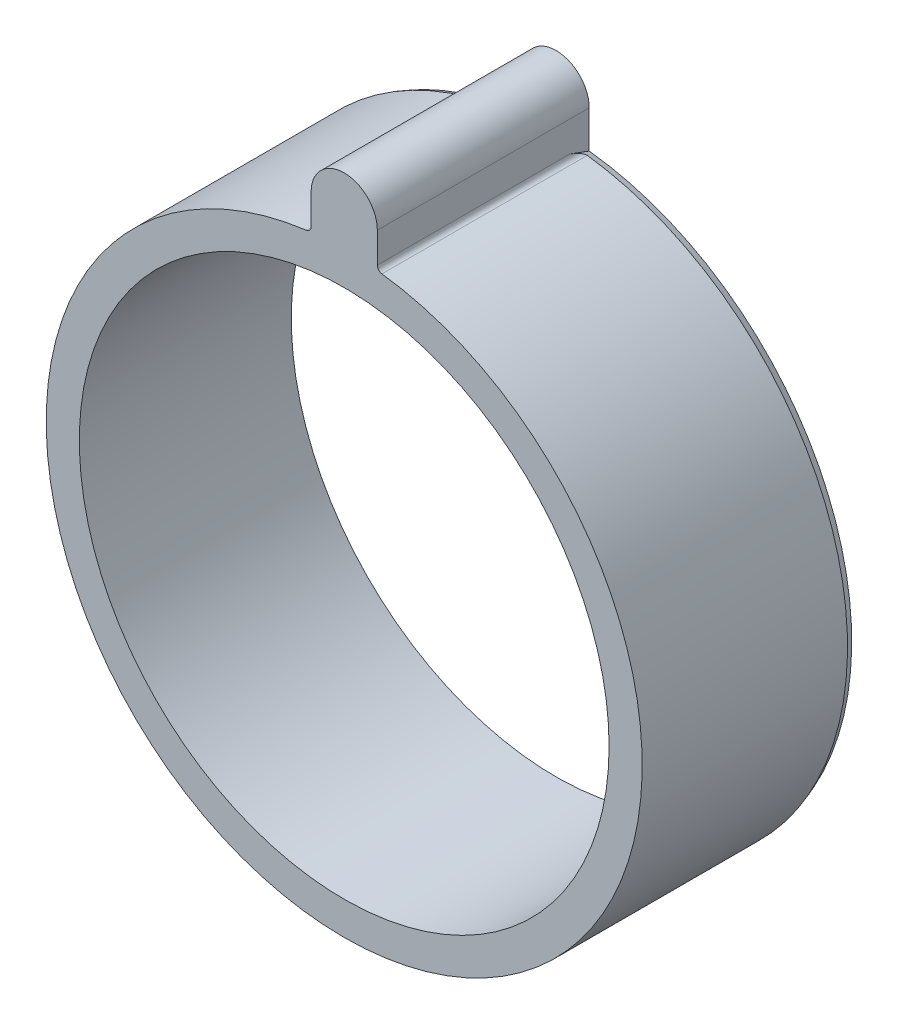
ISO-10303-21;
HEADER;
FILE_DESCRIPTION(('STEP AP214'),'2;1');
FILE_NAME('part.step','',(''),(''),'','','');
FILE_SCHEMA(('AUTOMOTIVE_DESIGN { 1 0 10303 214 1 1 1 1 }'));
ENDSEC;
DATA;
#1=APPLICATION_CONTEXT('core data for automotive mechanical design processes');
#2=APPLICATION_PROTOCOL_DEFINITION('international standard','automotive_design',2000,#1);
#3=PRODUCT_CONTEXT('',#1,'mechanical');
#4=PRODUCT('Part','Part','',(#3));
#5=PRODUCT_RELATED_PRODUCT_CATEGORY('part','',(#4));
#6=PRODUCT_DEFINITION_FORMATION('','',#4);
#7=PRODUCT_DEFINITION_CONTEXT('part definition',#1,'design');
#8=PRODUCT_DEFINITION('design','',#6,#7);
#9=PRODUCT_DEFINITION_SHAPE('','',#8);
#10=(LENGTH_UNIT() NAMED_UNIT(*) SI_UNIT(.MILLI.,.METRE.));
#11=(NAMED_UNIT(*) PLANE_ANGLE_UNIT() SI_UNIT($,.RADIAN.));
#12=(NAMED_UNIT(*) SI_UNIT($,.STERADIAN.) SOLID_ANGLE_UNIT());
#13=UNCERTAINTY_MEASURE_WITH_UNIT(LENGTH_MEASURE(1.E-05),#10,'distance_accuracy_value','');
#14=(GEOMETRIC_REPRESENTATION_CONTEXT(3) GLOBAL_UNCERTAINTY_ASSIGNED_CONTEXT((#13)) GLOBAL_UNIT_ASSIGNED_CONTEXT((#10,
#11,#12)) REPRESENTATION_CONTEXT('',''));
#15=CARTESIAN_POINT('',(0.,0.,0.));
#16=DIRECTION('',(0.,0.,1.));
#17=DIRECTION('',(1.,0.,0.));
#18=AXIS2_PLACEMENT_3D('',#15,#16,#17);
#19=CARTESIAN_POINT('',(0.,0.,16.));
#20=DIRECTION('',(0.,0.,1.));
#21=DIRECTION('',(1.,0.,0.));
#22=AXIS2_PLACEMENT_3D('',#19,#20,#21);
#23=PLANE('',#22);
#24=DIRECTION('',(0.,-1.,0.));
#25=VECTOR('',#24,1.);
#26=CARTESIAN_POINT('',(-2.5,25.,16.));
#27=LINE('',#26,#25);
#28=CARTESIAN_POINT('',(-2.5,25.,16.));
#29=VERTEX_POINT('',#28);
#30=CARTESIAN_POINT('',(-2.5,22.7156333832011,16.));
#31=VERTEX_POINT('',#30);
#32=EDGE_CURVE('E115',#29,#31,#27,.T.);
#33=ORIENTED_EDGE('',*,*,#32,.T.);
#34=CARTESIAN_POINT('',(-2.9,22.7156333832011,16.));
#35=DIRECTION('',(0.,0.,1.));
#36=DIRECTION('',(1.,0.,0.));
#37=AXIS2_PLACEMENT_3D('',#34,#35,#36);
#38=CIRCLE('',#37,0.4);
#39=CARTESIAN_POINT('',(-2.84934497816594,22.3188537607871,16.));
#40=VERTEX_POINT('',#39);
#41=EDGE_CURVE('E53',#31,#40,#38,.F.);
#42=ORIENTED_EDGE('',*,*,#41,.T.);
#43=CARTESIAN_POINT('',(0.,0.,16.));
#44=DIRECTION('',(0.,0.,1.));
#45=DIRECTION('',(1.,0.,0.));
#46=AXIS2_PLACEMENT_3D('',#43,#44,#45);
#47=CIRCLE('',#46,22.5);
#48=CARTESIAN_POINT('',(2.84934497816594,22.3188537607871,16.));
#49=VERTEX_POINT('',#48);
#50=EDGE_CURVE('E136',#40,#49,#47,.T.);
#51=ORIENTED_EDGE('',*,*,#50,.T.);
#52=CARTESIAN_POINT('',(2.9,22.7156333832011,16.));
#53=DIRECTION('',(0.,0.,1.));
#54=DIRECTION('',(1.,0.,0.));
#55=AXIS2_PLACEMENT_3D('',#52,#53,#54);
#56=CIRCLE('',#55,0.4);
#57=CARTESIAN_POINT('',(2.5,22.7156333832011,16.));
#58=VERTEX_POINT('',#57);
#59=EDGE_CURVE('E200',#49,#58,#56,.F.);
#60=ORIENTED_EDGE('',*,*,#59,.T.);
#61=DIRECTION('',(0.,1.,0.));
#62=VECTOR('',#61,1.);
#63=CARTESIAN_POINT('',(2.5,25.,16.));
#64=LINE('',#63,#62);
#65=CARTESIAN_POINT('',(2.5,25.,16.));
#66=VERTEX_POINT('',#65);
#67=EDGE_CURVE('E112',#58,#66,#64,.T.);
#68=ORIENTED_EDGE('',*,*,#67,.T.);
#69=CARTESIAN_POINT('',(0.,25.,16.));
#70=DIRECTION('',(0.,0.,1.));
#71=DIRECTION('',(-1.,0.,0.));
#72=AXIS2_PLACEMENT_3D('',#69,#70,#71);
#73=CIRCLE('',#72,2.5);
#74=EDGE_CURVE('E109',#66,#29,#73,.T.);
#75=ORIENTED_EDGE('',*,*,#74,.T.);
#76=EDGE_LOOP('',(#33,#42,#51,#60,#68,#75));
#77=FACE_BOUND('',#76,.T.);
#78=CARTESIAN_POINT('',(0.,0.,16.));
#79=DIRECTION('',(0.,0.,1.));
#80=DIRECTION('',(1.,0.,0.));
#81=AXIS2_PLACEMENT_3D('',#78,#79,#80);
#82=CIRCLE('',#81,20.);
#83=CARTESIAN_POINT('',(20.,0.,16.));
#84=VERTEX_POINT('',#83);
#85=EDGE_CURVE('E133',#84,#84,#82,.T.);
#86=ORIENTED_EDGE('',*,*,#85,.F.);
#87=EDGE_LOOP('',(#86));
#88=FACE_BOUND('',#87,.T.);
#89=ADVANCED_FACE('F39',(#77,#88),#23,.T.);
#90=CARTESIAN_POINT('',(0.,0.,0.));
#91=DIRECTION('',(0.,0.,1.));
#92=DIRECTION('',(1.,0.,0.));
#93=AXIS2_PLACEMENT_3D('',#90,#91,#92);
#94=PLANE('',#93);
#95=DIRECTION('',(0.,-1.,0.));
#96=VECTOR('',#95,1.);
#97=CARTESIAN_POINT('',(2.5,25.,0.));
#98=LINE('',#97,#96);
#99=CARTESIAN_POINT('',(2.5,25.,0.));
#100=VERTEX_POINT('',#99);
#101=CARTESIAN_POINT('',(2.5,22.1775514498754,0.));
#102=VERTEX_POINT('',#101);
#103=EDGE_CURVE('E128',#100,#102,#98,.T.);
#104=ORIENTED_EDGE('',*,*,#103,.T.);
#105=CARTESIAN_POINT('',(0.,0.,0.));
#106=DIRECTION('',(0.,0.,1.));
#107=DIRECTION('',(1.,0.,0.));
#108=AXIS2_PLACEMENT_3D('',#105,#106,#107);
#109=CIRCLE('',#108,22.3180148828669);
#110=CARTESIAN_POINT('',(-2.5,22.1775514498754,0.));
#111=VERTEX_POINT('',#110);
#112=EDGE_CURVE('E144',#102,#111,#109,.F.);
#113=ORIENTED_EDGE('',*,*,#112,.T.);
#114=DIRECTION('',(0.,1.,0.));
#115=VECTOR('',#114,1.);
#116=CARTESIAN_POINT('',(-2.5,25.,0.));
#117=LINE('',#116,#115);
#118=CARTESIAN_POINT('',(-2.5,25.,0.));
#119=VERTEX_POINT('',#118);
#120=EDGE_CURVE('E130',#111,#119,#117,.T.);
#121=ORIENTED_EDGE('',*,*,#120,.T.);
#122=CARTESIAN_POINT('',(0.,25.,0.));
#123=DIRECTION('',(0.,0.,1.));
#124=DIRECTION('',(1.,0.,0.));
#125=AXIS2_PLACEMENT_3D('',#122,#123,#124);
#126=CIRCLE('',#125,2.5);
#127=EDGE_CURVE('E110',#119,#100,#126,.F.);
#128=ORIENTED_EDGE('',*,*,#127,.T.);
#129=EDGE_LOOP('',(#104,#113,#121,#128));
#130=FACE_BOUND('',#129,.T.);
#131=CARTESIAN_POINT('',(0.,0.,0.));
#132=DIRECTION('',(0.,0.,1.));
#133=DIRECTION('',(1.,0.,0.));
#134=AXIS2_PLACEMENT_3D('',#131,#132,#133);
#135=CIRCLE('',#134,20.);
#136=CARTESIAN_POINT('',(20.,0.,0.));
#137=VERTEX_POINT('',#136);
#138=EDGE_CURVE('E132',#137,#137,#135,.T.);
#139=ORIENTED_EDGE('',*,*,#138,.T.);
#140=EDGE_LOOP('',(#139));
#141=FACE_BOUND('',#140,.T.);
#142=ADVANCED_FACE('F180',(#130,#141),#94,.F.);
#143=CARTESIAN_POINT('',(0.,0.,16.));
#144=DIRECTION('',(0.,0.,-1.));
#145=DIRECTION('',(-1.,0.,0.));
#146=AXIS2_PLACEMENT_3D('',#143,#144,#145);
#147=CYLINDRICAL_SURFACE('',#146,22.5);
#148=CARTESIAN_POINT('',(0.,0.,0.500000000000007));
#149=DIRECTION('',(0.,0.,1.));
#150=DIRECTION('',(1.,0.,0.));
#151=AXIS2_PLACEMENT_3D('',#148,#149,#150);
#152=CIRCLE('',#151,22.5);
#153=CARTESIAN_POINT('',(-2.84934497816594,22.3188537607871,0.500000000000007));
#154=VERTEX_POINT('',#153);
#155=CARTESIAN_POINT('',(2.84934497816594,22.3188537607871,0.500000000000007));
#156=VERTEX_POINT('',#155);
#157=EDGE_CURVE('E141',#154,#156,#152,.T.);
#158=ORIENTED_EDGE('',*,*,#157,.T.);
#159=DIRECTION('',(0.,0.,-1.));
#160=VECTOR('',#159,1.);
#161=CARTESIAN_POINT('',(2.84934497816594,22.3188537607871,16.));
#162=LINE('',#161,#160);
#163=EDGE_CURVE('E191',#156,#49,#162,.F.);
#164=ORIENTED_EDGE('',*,*,#163,.T.);
#165=ORIENTED_EDGE('',*,*,#50,.F.);
#166=DIRECTION('',(0.,0.,-1.));
#167=VECTOR('',#166,1.);
#168=CARTESIAN_POINT('',(-2.84934497816594,22.3188537607871,16.));
#169=LINE('',#168,#167);
#170=EDGE_CURVE('E192',#40,#154,#169,.T.);
#171=ORIENTED_EDGE('',*,*,#170,.T.);
#172=EDGE_LOOP('',(#158,#164,#165,#171));
#173=FACE_BOUND('',#172,.T.);
#174=ADVANCED_FACE('F176',(#173),#147,.T.);
#175=CARTESIAN_POINT('',(0.,0.,16.));
#176=DIRECTION('',(0.,0.,-1.));
#177=DIRECTION('',(-1.,0.,0.));
#178=AXIS2_PLACEMENT_3D('',#175,#176,#177);
#179=CYLINDRICAL_SURFACE('',#178,20.);
#180=ORIENTED_EDGE('',*,*,#85,.T.);
#181=EDGE_LOOP('',(#180));
#182=FACE_BOUND('',#181,.T.);
#183=ORIENTED_EDGE('',*,*,#138,.F.);
#184=EDGE_LOOP('',(#183));
#185=FACE_BOUND('',#184,.T.);
#186=ADVANCED_FACE('F173',(#182,#185),#179,.F.);
#187=CARTESIAN_POINT('',(0.,25.,-7.1702588778311));
#188=DIRECTION('',(0.,0.,1.));
#189=DIRECTION('',(1.,0.,0.));
#190=AXIS2_PLACEMENT_3D('',#187,#188,#189);
#191=CYLINDRICAL_SURFACE('',#190,2.5);
#192=ORIENTED_EDGE('',*,*,#127,.F.);
#193=DIRECTION('',(0.,0.,1.));
#194=VECTOR('',#193,1.);
#195=CARTESIAN_POINT('',(-2.5,25.,-7.1702588778311));
#196=LINE('',#195,#194);
#197=EDGE_CURVE('E104',#119,#29,#196,.T.);
#198=ORIENTED_EDGE('',*,*,#197,.T.);
#199=ORIENTED_EDGE('',*,*,#74,.F.);
#200=DIRECTION('',(0.,0.,1.));
#201=VECTOR('',#200,1.);
#202=CARTESIAN_POINT('',(2.5,25.,-7.1702588778311));
#203=LINE('',#202,#201);
#204=EDGE_CURVE('E111',#100,#66,#203,.T.);
#205=ORIENTED_EDGE('',*,*,#204,.F.);
#206=EDGE_LOOP('',(#192,#198,#199,#205));
#207=FACE_BOUND('',#206,.T.);
#208=ADVANCED_FACE('F106',(#207),#191,.T.);
#209=CARTESIAN_POINT('',(2.5,25.,-7.1702588778311));
#210=DIRECTION('',(1.,0.,0.));
#211=DIRECTION('',(0.,1.,0.));
#212=AXIS2_PLACEMENT_3D('',#209,#210,#211);
#213=PLANE('',#212);
#214=ORIENTED_EDGE('',*,*,#67,.F.);
#215=DIRECTION('',(0.,0.,-1.));
#216=VECTOR('',#215,1.);
#217=CARTESIAN_POINT('',(2.5,22.7156333832011,-7.1702588778311));
#218=LINE('',#217,#216);
#219=CARTESIAN_POINT('',(2.5,22.7156333832011,1.46928191055004));
#220=VERTEX_POINT('',#219);
#221=EDGE_CURVE('E201',#58,#220,#218,.T.);
#222=ORIENTED_EDGE('',*,*,#221,.T.);
#223=CARTESIAN_POINT('',(2.5,22.7156333832011,1.46928191055004));
#224=CARTESIAN_POINT('',(2.5,22.597325661549,1.14618422396013));
#225=CARTESIAN_POINT('',(2.5,22.4790077921479,0.823090253776789));
#226=CARTESIAN_POINT('',(2.5,22.2996397003356,0.333332344374636));
#227=CARTESIAN_POINT('',(2.5,22.2385969252948,0.166665677707967));
#228=CARTESIAN_POINT('',(2.5,22.1775514498754,0.));
#229=B_SPLINE_CURVE_WITH_KNOTS('',3,(#223,#224,#225,#226,#227,#228),.UNSPECIFIED.,.F.,.F.,(4,2,
4),(0.,1.03223034546364,1.56471131551064),.UNSPECIFIED.);
#230=EDGE_CURVE('E147',#220,#102,#229,.T.);
#231=ORIENTED_EDGE('',*,*,#230,.T.);
#232=ORIENTED_EDGE('',*,*,#103,.F.);
#233=ORIENTED_EDGE('',*,*,#204,.T.);
#234=EDGE_LOOP('',(#214,#222,#231,#232,#233));
#235=FACE_BOUND('',#234,.T.);
#236=ADVANCED_FACE('F164',(#235),#213,.T.);
#237=CARTESIAN_POINT('',(-2.5,25.,-7.1702588778311));
#238=DIRECTION('',(-1.,0.,0.));
#239=DIRECTION('',(0.,-1.,0.));
#240=AXIS2_PLACEMENT_3D('',#237,#238,#239);
#241=PLANE('',#240);
#242=CARTESIAN_POINT('',(-2.5,22.1775514498754,0.));
#243=CARTESIAN_POINT('',(-2.5,22.2385969252948,0.166665677707967));
#244=CARTESIAN_POINT('',(-2.5,22.2996397003356,0.333332344374636));
#245=CARTESIAN_POINT('',(-2.5,22.4790077921479,0.82309025377679));
#246=CARTESIAN_POINT('',(-2.5,22.597325661549,1.14618422396013));
#247=CARTESIAN_POINT('',(-2.5,22.7156333832011,1.46928191055004));
#248=B_SPLINE_CURVE_WITH_KNOTS('',3,(#242,#243,#244,#245,#246,#247),.UNSPECIFIED.,.F.,.F.,(4,2,
4),(0.,0.532480970047001,1.56471131551064),.UNSPECIFIED.);
#249=CARTESIAN_POINT('',(-2.5,22.7156333832011,1.46928191055004));
#250=VERTEX_POINT('',#249);
#251=EDGE_CURVE('E60',#111,#250,#248,.T.);
#252=ORIENTED_EDGE('',*,*,#251,.T.);
#253=DIRECTION('',(0.,0.,-1.));
#254=VECTOR('',#253,1.);
#255=CARTESIAN_POINT('',(-2.5,22.7156333832011,-7.1702588778311));
#256=LINE('',#255,#254);
#257=EDGE_CURVE('E117',#250,#31,#256,.F.);
#258=ORIENTED_EDGE('',*,*,#257,.T.);
#259=ORIENTED_EDGE('',*,*,#32,.F.);
#260=ORIENTED_EDGE('',*,*,#197,.F.);
#261=ORIENTED_EDGE('',*,*,#120,.F.);
#262=EDGE_LOOP('',(#252,#258,#259,#260,#261));
#263=FACE_BOUND('',#262,.T.);
#264=ADVANCED_FACE('F116',(#263),#241,.T.);
#265=CARTESIAN_POINT('',(0.,0.,0.500000000000007));
#266=DIRECTION('',(0.,0.,1.));
#267=DIRECTION('',(1.,0.,0.));
#268=AXIS2_PLACEMENT_3D('',#265,#266,#267);
#269=CONICAL_SURFACE('',#268,22.5,0.349065850398861);
#270=ORIENTED_EDGE('',*,*,#251,.F.);
#271=ORIENTED_EDGE('',*,*,#112,.F.);
#272=ORIENTED_EDGE('',*,*,#230,.F.);
#273=CARTESIAN_POINT('',(2.5,22.7156333832011,1.46928191055004));
#274=CARTESIAN_POINT('',(2.50000192493231,22.7042578531929,1.43821614772649));
#275=CARTESIAN_POINT('',(2.50048438834367,22.6928369567121,1.40717096364287));
#276=CARTESIAN_POINT('',(2.50245595860717,22.669903101481,1.34513427997803));
#277=CARTESIAN_POINT('',(2.50394542468342,22.6583901113273,1.31414280351237));
#278=CARTESIAN_POINT('',(2.51004374622932,22.6234279086136,1.22051007554359));
#279=CARTESIAN_POINT('',(2.51628514184384,22.5998464085694,1.1580060038236));
#280=CARTESIAN_POINT('',(2.52967610432765,22.563878942228,1.06388850484792));
#281=CARTESIAN_POINT('',(2.53492564573257,22.5515957453108,1.03195908505263));
#282=CARTESIAN_POINT('',(2.54702304011259,22.5269639040905,0.968432985900389));
#283=CARTESIAN_POINT('',(2.5538704447194,22.5146152790951,0.936836215794927));
#284=CARTESIAN_POINT('',(2.5694393111456,22.4899310655111,0.874290435927235));
#285=CARTESIAN_POINT('',(2.57815121258051,22.4775957215326,0.843338974055171));
#286=CARTESIAN_POINT('',(2.59794949687018,22.4529219347645,0.782218750509542));
#287=CARTESIAN_POINT('',(2.60903318763368,22.4405835111993,0.75204914456074));
#288=CARTESIAN_POINT('',(2.62876908820094,22.4214756174575,0.706201459176869));
#289=CARTESIAN_POINT('',(2.63630355501161,22.4146748521007,0.690057146277416));
#290=CARTESIAN_POINT('',(2.65261328857511,22.4011294799934,0.658349811816629));
#291=CARTESIAN_POINT('',(2.66138962385319,22.3943849269567,0.642787305583973));
#292=CARTESIAN_POINT('',(2.68058750984192,22.3809740168902,0.612449015276655));
#293=CARTESIAN_POINT('',(2.69102251045424,22.3743088247027,0.59768111286172));
#294=CARTESIAN_POINT('',(2.71397180107856,22.361278055781,0.569700876100408));
#295=CARTESIAN_POINT('',(2.72647906584701,22.3549115569599,0.556483535308337));
#296=CARTESIAN_POINT('',(2.74746591590215,22.3457778508099,0.538593184484123));
#297=CARTESIAN_POINT('',(2.75495040730471,22.3427646136131,0.532888655623412));
#298=CARTESIAN_POINT('',(2.77071311073958,22.3370106391887,0.522514755281589));
#299=CARTESIAN_POINT('',(2.77899073733942,22.3342697039662,0.517844628587751));
#300=CARTESIAN_POINT('',(2.79495200909085,22.3295987647419,0.510542173776725));
#301=CARTESIAN_POINT('',(2.80252263850288,22.3276090644099,0.507704396857778));
#302=CARTESIAN_POINT('',(2.81810223213672,22.3240266562852,0.503284916525408));
#303=CARTESIAN_POINT('',(2.82610993002546,22.3224328688671,0.501699770914151));
#304=CARTESIAN_POINT('',(2.83923434855224,22.3202422716091,0.500271091294549));
#305=CARTESIAN_POINT('',(2.84428243234935,22.3194974961855,0.499992842240241));
#306=CARTESIAN_POINT('',(2.84934497816594,22.3188537607871,0.500000000000012));
#307=B_SPLINE_CURVE_WITH_KNOTS('',3,(#273,#274,#275,#276,#277,#278,#279,#280,#281,#282,#283,
#284,#285,#286,#287,#288,#289,#290,#291,#292,#293,#294,#295,#296,#297,#298,#299,#300,#301,#302,
#303,#304,#305,#306),.UNSPECIFIED.,.F.,.F.,(4,2,2,2,2,2,2,2,2,2,2,2,2,2,2,2,4),(0.,
0.099237249749412,0.198509918705497,0.399592402204581,0.5033976659599,0.60717383639763,
0.710430115608807,0.813569809975554,0.870744357527812,0.927968401614198,0.985682663680228,
1.0432051267977,1.07278313783145,1.10233948237452,1.12722267846065,1.15203725606338,
1.16733837151504),.UNSPECIFIED.);
#308=EDGE_CURVE('E199',#220,#156,#307,.T.);
#309=ORIENTED_EDGE('',*,*,#308,.T.);
#310=ORIENTED_EDGE('',*,*,#157,.F.);
#311=CARTESIAN_POINT('',(-2.84934497816594,22.3188537607871,0.500000000000007));
#312=CARTESIAN_POINT('',(-2.84070349958176,22.3199477604656,0.499974384373462));
#313=CARTESIAN_POINT('',(-2.8321383962626,22.3213368197992,0.500794349840977));
#314=CARTESIAN_POINT('',(-2.81548130444507,22.3245763243717,0.503881422982244));
#315=CARTESIAN_POINT('',(-2.80738450074855,22.3264203101118,0.506128910676941));
#316=CARTESIAN_POINT('',(-2.7897668795478,22.3309879271095,0.512558918223654));
#317=CARTESIAN_POINT('',(-2.78040236024281,22.3338161101827,0.517086634096403));
#318=CARTESIAN_POINT('',(-2.76258382472559,22.3398598017042,0.527537025061295));
#319=CARTESIAN_POINT('',(-2.75413522432476,22.3430773986485,0.533467400803508));
#320=CARTESIAN_POINT('',(-2.73241278555559,22.3521274438096,0.550866908088681));
#321=CARTESIAN_POINT('',(-2.71999384186132,22.3581884771678,0.56327023907043));
#322=CARTESIAN_POINT('',(-2.69718370441517,22.3706204847456,0.589644160944499));
#323=CARTESIAN_POINT('',(-2.68679711302645,22.3769921225344,0.603618198733027));
#324=CARTESIAN_POINT('',(-2.66375387903973,22.3924459731157,0.638257980053933));
#325=CARTESIAN_POINT('',(-2.65183474741902,22.401599388155,0.659376642846793));
#326=CARTESIAN_POINT('',(-2.63016051882412,22.4200190447843,0.70266727212533));
#327=CARTESIAN_POINT('',(-2.62040993770572,22.4292854802033,0.724841322012586));
#328=CARTESIAN_POINT('',(-2.60250356819919,22.4479314787026,0.770039912949452));
#329=CARTESIAN_POINT('',(-2.59436318530767,22.4573113011937,0.793070378723726));
#330=CARTESIAN_POINT('',(-2.57946247613641,22.4760541695478,0.839545087873633));
#331=CARTESIAN_POINT('',(-2.57270089984934,22.4854172229098,0.862988935340747));
#332=CARTESIAN_POINT('',(-2.55381204327523,22.5139270412865,0.934930848712117));
#333=CARTESIAN_POINT('',(-2.54349425872872,22.533036406733,0.983919520143455));
#334=CARTESIAN_POINT('',(-2.52644509779974,22.5711043182616,1.08262386509699));
#335=CARTESIAN_POINT('',(-2.51971902154022,22.5900626010135,1.13234050238856));
#336=CARTESIAN_POINT('',(-2.50951063510708,22.626929242673,1.22990967207421));
#337=CARTESIAN_POINT('',(-2.50589589119965,22.644846436574,1.27774532927416));
#338=CARTESIAN_POINT('',(-2.50115724667418,22.6804235757403,1.37347298812871));
#339=CARTESIAN_POINT('',(-2.50002586900792,22.6980841337397,1.42136438506587));
#340=CARTESIAN_POINT('',(-2.5,22.7156333832011,1.46928191055003));
#341=B_SPLINE_CURVE_WITH_KNOTS('',3,(#311,#312,#313,#314,#315,#316,#317,#318,#319,#320,#321,
#322,#323,#324,#325,#326,#327,#328,#329,#330,#331,#332,#333,#334,#335,#336,#337,#338,#339,#340),
.UNSPECIFIED.,.F.,.F.,(4,2,2,2,2,2,2,2,2,2,2,2,2,2,4),(0.,0.0260262317755087,0.05170227641194,
0.083858050799317,0.11619463596446,0.171588472487329,0.227106335101817,0.304680581739917,
0.382414889455781,0.460860325809393,0.539234325282019,0.699801976882674,0.860605920745919,
1.01416853276264,1.16726815260088),.UNSPECIFIED.);
#342=EDGE_CURVE('E11',#154,#250,#341,.T.);
#343=ORIENTED_EDGE('',*,*,#342,.T.);
#344=EDGE_LOOP('',(#270,#271,#272,#309,#310,#343));
#345=FACE_BOUND('',#344,.T.);
#346=ADVANCED_FACE('F161',(#345),#269,.T.);
#347=CARTESIAN_POINT('',(2.9,22.7156333832011,16.));
#348=DIRECTION('',(0.,0.,-1.));
#349=DIRECTION('',(-1.,0.,0.));
#350=AXIS2_PLACEMENT_3D('',#347,#348,#349);
#351=CYLINDRICAL_SURFACE('',#350,0.4);
#352=ORIENTED_EDGE('',*,*,#308,.F.);
#353=ORIENTED_EDGE('',*,*,#221,.F.);
#354=ORIENTED_EDGE('',*,*,#59,.F.);
#355=ORIENTED_EDGE('',*,*,#163,.F.);
#356=EDGE_LOOP('',(#352,#353,#354,#355));
#357=FACE_BOUND('',#356,.T.);
#358=ADVANCED_FACE('F197',(#357),#351,.F.);
#359=CARTESIAN_POINT('',(-2.9,22.7156333832011,16.));
#360=DIRECTION('',(0.,0.,-1.));
#361=DIRECTION('',(-1.,0.,0.));
#362=AXIS2_PLACEMENT_3D('',#359,#360,#361);
#363=CYLINDRICAL_SURFACE('',#362,0.4);
#364=ORIENTED_EDGE('',*,*,#342,.F.);
#365=ORIENTED_EDGE('',*,*,#170,.F.);
#366=ORIENTED_EDGE('',*,*,#41,.F.);
#367=ORIENTED_EDGE('',*,*,#257,.F.);
#368=EDGE_LOOP('',(#364,#365,#366,#367));
#369=FACE_BOUND('',#368,.T.);
#370=ADVANCED_FACE('F41',(#369),#363,.F.);
#371=CLOSED_SHELL('',(#89,#142,#174,#186,#208,#236,#264,#346,#358,#370));
#372=MANIFOLD_SOLID_BREP('B2',#371);
#373=ADVANCED_BREP_SHAPE_REPRESENTATION('',(#18,#372),#14);
#374=SHAPE_DEFINITION_REPRESENTATION(#9,#373);
ENDSEC;
END-ISO-10303-21;
